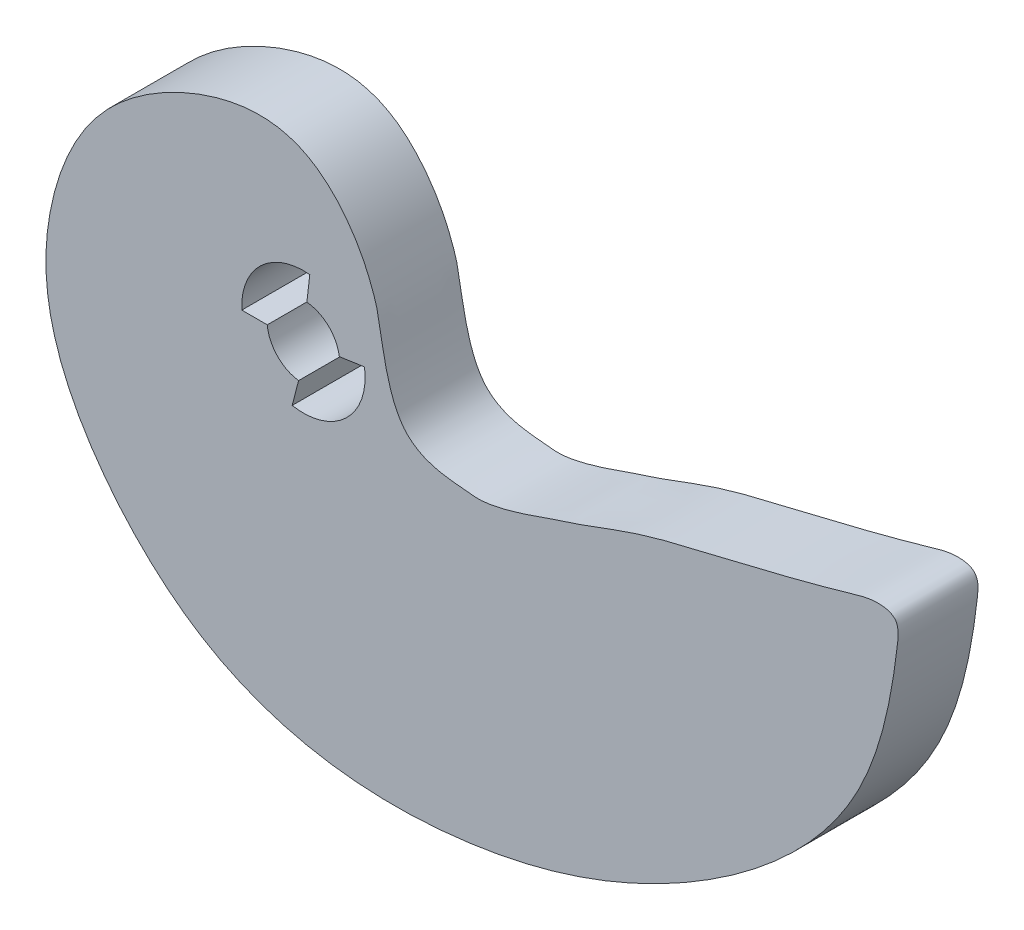
ISO-10303-21;
HEADER;
FILE_DESCRIPTION(('STEP AP214'),'2;1');
FILE_NAME('part.step','',(''),(''),'','','');
FILE_SCHEMA(('AUTOMOTIVE_DESIGN { 1 0 10303 214 1 1 1 1 }'));
ENDSEC;
DATA;
#1=APPLICATION_CONTEXT('core data for automotive mechanical design processes');
#2=APPLICATION_PROTOCOL_DEFINITION('international standard','automotive_design',2000,#1);
#3=PRODUCT_CONTEXT('',#1,'mechanical');
#4=PRODUCT('Part','Part','',(#3));
#5=PRODUCT_RELATED_PRODUCT_CATEGORY('part','',(#4));
#6=PRODUCT_DEFINITION_FORMATION('','',#4);
#7=PRODUCT_DEFINITION_CONTEXT('part definition',#1,'design');
#8=PRODUCT_DEFINITION('design','',#6,#7);
#9=PRODUCT_DEFINITION_SHAPE('','',#8);
#10=(LENGTH_UNIT() NAMED_UNIT(*) SI_UNIT(.MILLI.,.METRE.));
#11=(NAMED_UNIT(*) PLANE_ANGLE_UNIT() SI_UNIT($,.RADIAN.));
#12=(NAMED_UNIT(*) SI_UNIT($,.STERADIAN.) SOLID_ANGLE_UNIT());
#13=UNCERTAINTY_MEASURE_WITH_UNIT(LENGTH_MEASURE(1.E-05),#10,'distance_accuracy_value','');
#14=(GEOMETRIC_REPRESENTATION_CONTEXT(3) GLOBAL_UNCERTAINTY_ASSIGNED_CONTEXT((#13)) GLOBAL_UNIT_ASSIGNED_CONTEXT((#10,
#11,#12)) REPRESENTATION_CONTEXT('',''));
#15=CARTESIAN_POINT('',(0.,0.,0.));
#16=DIRECTION('',(0.,0.,1.));
#17=DIRECTION('',(1.,0.,0.));
#18=AXIS2_PLACEMENT_3D('',#15,#16,#17);
#19=CARTESIAN_POINT('',(-82.747083106505,-112.580968106267,5.5));
#20=DIRECTION('',(0.,0.,-1.));
#21=DIRECTION('',(-1.,0.,0.));
#22=AXIS2_PLACEMENT_3D('',#19,#20,#21);
#23=CYLINDRICAL_SURFACE('',#22,2.5);
#24=CARTESIAN_POINT('',(-82.747083106505,-112.580968106267,0.));
#25=DIRECTION('',(0.,0.,1.));
#26=DIRECTION('',(1.,0.,0.));
#27=AXIS2_PLACEMENT_3D('',#24,#25,#26);
#28=CIRCLE('',#27,2.5);
#29=CARTESIAN_POINT('',(-85.2365939670514,-112.809738023916,0.));
#30=VERTEX_POINT('',#29);
#31=CARTESIAN_POINT('',(-83.0804098317707,-115.058647119824,0.));
#32=VERTEX_POINT('',#31);
#33=EDGE_CURVE('E172',#30,#32,#28,.T.);
#34=ORIENTED_EDGE('',*,*,#33,.F.);
#35=DIRECTION('',(0.,0.,-1.));
#36=VECTOR('',#35,1.);
#37=CARTESIAN_POINT('',(-85.2365939670514,-112.809738023916,5.5));
#38=LINE('',#37,#36);
#39=CARTESIAN_POINT('',(-85.2365939670514,-112.809738023916,5.5));
#40=VERTEX_POINT('',#39);
#41=EDGE_CURVE('E143',#30,#40,#38,.F.);
#42=ORIENTED_EDGE('',*,*,#41,.T.);
#43=CARTESIAN_POINT('',(-82.747083106505,-112.580968106267,5.5));
#44=DIRECTION('',(0.,0.,1.));
#45=DIRECTION('',(1.,0.,0.));
#46=AXIS2_PLACEMENT_3D('',#43,#44,#45);
#47=CIRCLE('',#46,2.5);
#48=CARTESIAN_POINT('',(-83.0804098317707,-115.058647119824,5.5));
#49=VERTEX_POINT('',#48);
#50=EDGE_CURVE('E159',#40,#49,#47,.T.);
#51=ORIENTED_EDGE('',*,*,#50,.T.);
#52=DIRECTION('',(0.,0.,-1.));
#53=VECTOR('',#52,1.);
#54=CARTESIAN_POINT('',(-83.0804098317707,-115.058647119824,5.5));
#55=LINE('',#54,#53);
#56=EDGE_CURVE('E189',#32,#49,#55,.F.);
#57=ORIENTED_EDGE('',*,*,#56,.F.);
#58=EDGE_LOOP('',(#34,#42,#51,#57));
#59=FACE_BOUND('',#58,.T.);
#60=ADVANCED_FACE('F63',(#59),#23,.F.);
#61=CARTESIAN_POINT('',(-80.0538215059245,-136.913003845688,5.5));
#62=DIRECTION('',(0.,0.,1.));
#63=DIRECTION('',(1.,0.,0.));
#64=AXIS2_PLACEMENT_3D('',#61,#62,#63);
#65=PLANE('',#64);
#66=DIRECTION('',(0.114648976582669,0.993406066102149,0.));
#67=VECTOR('',#66,1.);
#68=CARTESIAN_POINT('',(-82.5091861205217,-110.092312842061,5.5));
#69=LINE('',#68,#67);
#70=CARTESIAN_POINT('',(-82.5091861205217,-110.092312842061,5.5));
#71=VERTEX_POINT('',#70);
#72=CARTESIAN_POINT('',(-82.308527743859,-108.353655816656,5.5));
#73=VERTEX_POINT('',#72);
#74=EDGE_CURVE('E134',#71,#73,#69,.T.);
#75=ORIENTED_EDGE('',*,*,#74,.F.);
#76=CARTESIAN_POINT('',(-80.2723328598114,-112.226551379108,5.5));
#77=VERTEX_POINT('',#76);
#78=EDGE_CURVE('E149',#77,#71,#47,.T.);
#79=ORIENTED_EDGE('',*,*,#78,.F.);
#80=DIRECTION('',(0.989317671002193,0.145775669584459,0.));
#81=VECTOR('',#80,1.);
#82=CARTESIAN_POINT('',(-80.2723328598114,-112.226551379108,5.5));
#83=LINE('',#82,#81);
#84=CARTESIAN_POINT('',(-78.5410185788518,-111.971442725977,5.5));
#85=VERTEX_POINT('',#84);
#86=EDGE_CURVE('E88',#77,#85,#83,.T.);
#87=ORIENTED_EDGE('',*,*,#86,.T.);
#88=CARTESIAN_POINT('',(-82.747083106505,-112.580968106267,5.5));
#89=DIRECTION('',(0.,0.,1.));
#90=DIRECTION('',(1.,0.,0.));
#91=AXIS2_PLACEMENT_3D('',#88,#89,#90);
#92=CIRCLE('',#91,4.25);
#93=CARTESIAN_POINT('',(-83.5205793740157,-116.759987551561,5.5));
#94=VERTEX_POINT('',#93);
#95=EDGE_CURVE('E220',#94,#85,#92,.T.);
#96=ORIENTED_EDGE('',*,*,#95,.F.);
#97=DIRECTION('',(-0.250472269172787,-0.968123774305453,0.));
#98=VECTOR('',#97,1.);
#99=CARTESIAN_POINT('',(-83.0804098317707,-115.058647119824,5.5));
#100=LINE('',#99,#98);
#101=EDGE_CURVE('E153',#49,#94,#100,.T.);
#102=ORIENTED_EDGE('',*,*,#101,.F.);
#103=ORIENTED_EDGE('',*,*,#50,.F.);
#104=DIRECTION('',(-1.,0.,0.));
#105=VECTOR('',#104,1.);
#106=CARTESIAN_POINT('',(-85.2365939670514,-112.809738023916,5.5));
#107=LINE('',#106,#105);
#108=CARTESIAN_POINT('',(-86.9909215017291,-112.809738023916,5.5));
#109=VERTEX_POINT('',#108);
#110=EDGE_CURVE('E80',#40,#109,#107,.T.);
#111=ORIENTED_EDGE('',*,*,#110,.T.);
#112=CARTESIAN_POINT('',(-82.747083106505,-112.580968106267,5.5));
#113=DIRECTION('',(0.,0.,1.));
#114=DIRECTION('',(1.,0.,0.));
#115=AXIS2_PLACEMENT_3D('',#112,#113,#114);
#116=CIRCLE('',#115,4.24999999999999);
#117=EDGE_CURVE('E151',#73,#109,#116,.T.);
#118=ORIENTED_EDGE('',*,*,#117,.F.);
#119=EDGE_LOOP('',(#75,#79,#87,#96,#102,#103,#111,#118));
#120=FACE_BOUND('',#119,.T.);
#121=CARTESIAN_POINT('',(-75.8241532847992,-114.266820190174,5.5));
#122=CARTESIAN_POINT('',(-77.1557221348485,-112.607928015011,5.5));
#123=CARTESIAN_POINT('',(-77.3806502648745,-108.904511464068,5.5));
#124=CARTESIAN_POINT('',(-77.8121387753091,-107.611985546066,5.5));
#125=CARTESIAN_POINT('',(-78.3917743483822,-105.871169977248,5.5));
#126=CARTESIAN_POINT('',(-80.7248505298429,-101.84142076831,5.5));
#127=CARTESIAN_POINT('',(-85.9905700927967,-99.1704683096823,5.5));
#128=CARTESIAN_POINT('',(-96.907912796097,-104.287607140387,5.5));
#129=CARTESIAN_POINT('',(-101.038879113196,-113.876150436304,5.5));
#130=CARTESIAN_POINT('',(-100.288690875967,-123.302763721377,5.5));
#131=CARTESIAN_POINT('',(-89.2694683657181,-136.537216553467,5.5));
#132=CARTESIAN_POINT('',(-73.1958659313776,-138.052646926784,5.5));
#133=CARTESIAN_POINT('',(-57.4557380507836,-133.369952636039,5.5));
#134=CARTESIAN_POINT('',(-44.6915377434276,-123.535203138772,5.5));
#135=CARTESIAN_POINT('',(-42.254163283149,-114.266033288005,5.5));
#136=CARTESIAN_POINT('',(-41.6545611837149,-108.480623839518,5.5));
#137=CARTESIAN_POINT('',(-43.4662249462023,-108.263753115962,5.5));
#138=CARTESIAN_POINT('',(-48.0536315158961,-109.641165443734,5.5));
#139=CARTESIAN_POINT('',(-52.3940668403678,-110.660212357995,5.5));
#140=CARTESIAN_POINT('',(-60.6477748421622,-112.651012095243,5.5));
#141=CARTESIAN_POINT('',(-62.5068636779673,-113.612081965851,5.5));
#142=CARTESIAN_POINT('',(-64.545834482658,-114.220651876709,5.5));
#143=CARTESIAN_POINT('',(-65.8452441277517,-114.642388057961,5.5));
#144=CARTESIAN_POINT('',(-69.596857973629,-116.123048025933,5.5));
#145=CARTESIAN_POINT('',(-72.1359343470136,-115.757636843593,5.5));
#146=CARTESIAN_POINT('',(-74.672618993993,-115.701422106837,5.5));
#147=CARTESIAN_POINT('',(-75.8241532847992,-114.266820190174,5.5));
#148=B_SPLINE_CURVE_WITH_KNOTS('',3,(#121,#122,#123,#124,#125,#126,#127,#128,#129,#130,#131,
#132,#133,#134,#135,#136,#137,#138,#139,#140,#141,#142,#143,#144,#145,#146,#147),.UNSPECIFIED.,
.T.,.F.,(4,1,1,1,1,1,1,1,1,1,1,1,1,1,1,1,1,1,1,1,1,1,1,1,4),(0.,0.0196054816471226,
0.0206373491022343,0.0221288747249968,0.0504678615574836,0.122903140937827,0.200131011844295,
0.26697729309193,0.348315634888546,0.429985039825624,0.551961090925534,0.645021424160881,
0.75099193517591,0.821689296437961,0.830772391067562,0.840595049204765,0.848258209149405,
0.899740830569315,0.910874378432394,0.950809250009911,0.953158360102707,0.954558512900311,
0.978361110459581,0.983045274449311,0.999999999999999),.UNSPECIFIED.);
#149=CARTESIAN_POINT('',(-75.8241532847992,-114.266820190174,5.5));
#150=VERTEX_POINT('',#149);
#151=EDGE_CURVE('E164',#150,#150,#148,.T.);
#152=ORIENTED_EDGE('',*,*,#151,.T.);
#153=EDGE_LOOP('',(#152));
#154=FACE_BOUND('',#153,.T.);
#155=ADVANCED_FACE('F147',(#120,#154),#65,.T.);
#156=CARTESIAN_POINT('',(-80.0538215059245,-136.913003845688,0.));
#157=DIRECTION('',(0.,0.,1.));
#158=DIRECTION('',(1.,0.,0.));
#159=AXIS2_PLACEMENT_3D('',#156,#157,#158);
#160=PLANE('',#159);
#161=CARTESIAN_POINT('',(-75.8241532847992,-114.266820190174,0.));
#162=CARTESIAN_POINT('',(-77.1557221348485,-112.607928015011,0.));
#163=CARTESIAN_POINT('',(-77.3806502648745,-108.904511464068,0.));
#164=CARTESIAN_POINT('',(-77.8121387753091,-107.611985546066,0.));
#165=CARTESIAN_POINT('',(-78.3917743483822,-105.871169977248,0.));
#166=CARTESIAN_POINT('',(-80.7248505298429,-101.84142076831,0.));
#167=CARTESIAN_POINT('',(-85.9905700927967,-99.1704683096823,0.));
#168=CARTESIAN_POINT('',(-96.907912796097,-104.287607140387,0.));
#169=CARTESIAN_POINT('',(-101.038879113196,-113.876150436304,0.));
#170=CARTESIAN_POINT('',(-100.288690875967,-123.302763721377,0.));
#171=CARTESIAN_POINT('',(-89.2694683657181,-136.537216553467,0.));
#172=CARTESIAN_POINT('',(-73.1958659313776,-138.052646926784,0.));
#173=CARTESIAN_POINT('',(-57.4557380507836,-133.369952636039,0.));
#174=CARTESIAN_POINT('',(-44.6915377434276,-123.535203138772,0.));
#175=CARTESIAN_POINT('',(-42.254163283149,-114.266033288005,0.));
#176=CARTESIAN_POINT('',(-41.6545611837149,-108.480623839518,0.));
#177=CARTESIAN_POINT('',(-43.4662249462023,-108.263753115962,0.));
#178=CARTESIAN_POINT('',(-48.0536315158961,-109.641165443734,0.));
#179=CARTESIAN_POINT('',(-52.3940668403678,-110.660212357995,0.));
#180=CARTESIAN_POINT('',(-60.6477748421622,-112.651012095243,0.));
#181=CARTESIAN_POINT('',(-62.5068636779673,-113.612081965851,0.));
#182=CARTESIAN_POINT('',(-64.545834482658,-114.220651876709,0.));
#183=CARTESIAN_POINT('',(-65.8452441277517,-114.642388057961,0.));
#184=CARTESIAN_POINT('',(-69.596857973629,-116.123048025933,0.));
#185=CARTESIAN_POINT('',(-72.1359343470136,-115.757636843593,0.));
#186=CARTESIAN_POINT('',(-74.672618993993,-115.701422106837,0.));
#187=CARTESIAN_POINT('',(-75.8241532847992,-114.266820190174,0.));
#188=B_SPLINE_CURVE_WITH_KNOTS('',3,(#161,#162,#163,#164,#165,#166,#167,#168,#169,#170,#171,
#172,#173,#174,#175,#176,#177,#178,#179,#180,#181,#182,#183,#184,#185,#186,#187),.UNSPECIFIED.,
.T.,.F.,(4,1,1,1,1,1,1,1,1,1,1,1,1,1,1,1,1,1,1,1,1,1,1,1,4),(0.,0.0196054816471226,
0.0206373491022343,0.0221288747249968,0.0504678615574836,0.122903140937827,0.200131011844295,
0.26697729309193,0.348315634888546,0.429985039825624,0.551961090925534,0.645021424160881,
0.75099193517591,0.821689296437961,0.830772391067562,0.840595049204765,0.848258209149405,
0.899740830569315,0.910874378432394,0.950809250009911,0.953158360102707,0.954558512900311,
0.978361110459581,0.983045274449311,0.999999999999999),.UNSPECIFIED.);
#189=CARTESIAN_POINT('',(-75.8241532847992,-114.266820190174,0.));
#190=VERTEX_POINT('',#189);
#191=EDGE_CURVE('E158',#190,#190,#188,.T.);
#192=ORIENTED_EDGE('',*,*,#191,.F.);
#193=EDGE_LOOP('',(#192));
#194=FACE_BOUND('',#193,.T.);
#195=CARTESIAN_POINT('',(-80.2723328598114,-112.226551379108,0.));
#196=VERTEX_POINT('',#195);
#197=CARTESIAN_POINT('',(-82.5091861205217,-110.092312842061,0.));
#198=VERTEX_POINT('',#197);
#199=EDGE_CURVE('E167',#196,#198,#28,.T.);
#200=ORIENTED_EDGE('',*,*,#199,.T.);
#201=DIRECTION('',(0.114648976582669,0.993406066102149,0.));
#202=VECTOR('',#201,1.);
#203=CARTESIAN_POINT('',(-85.5316005161024,-136.280813466655,0.));
#204=LINE('',#203,#202);
#205=CARTESIAN_POINT('',(-82.308527743859,-108.353655816656,0.));
#206=VERTEX_POINT('',#205);
#207=EDGE_CURVE('E137',#198,#206,#204,.T.);
#208=ORIENTED_EDGE('',*,*,#207,.T.);
#209=CARTESIAN_POINT('',(-82.747083106505,-112.580968106267,0.));
#210=DIRECTION('',(0.,0.,1.));
#211=DIRECTION('',(1.,0.,0.));
#212=AXIS2_PLACEMENT_3D('',#209,#210,#211);
#213=CIRCLE('',#212,4.24999999999999);
#214=CARTESIAN_POINT('',(-86.9909215017291,-112.809738023916,0.));
#215=VERTEX_POINT('',#214);
#216=EDGE_CURVE('E12',#206,#215,#213,.T.);
#217=ORIENTED_EDGE('',*,*,#216,.T.);
#218=DIRECTION('',(-1.,0.,0.));
#219=VECTOR('',#218,1.);
#220=CARTESIAN_POINT('',(-80.0538215059245,-112.809738023916,0.));
#221=LINE('',#220,#219);
#222=EDGE_CURVE('E226',#30,#215,#221,.T.);
#223=ORIENTED_EDGE('',*,*,#222,.F.);
#224=ORIENTED_EDGE('',*,*,#33,.T.);
#225=DIRECTION('',(-0.250472269172787,-0.968123774305453,0.));
#226=VECTOR('',#225,1.);
#227=CARTESIAN_POINT('',(-88.1899554238107,-134.808029276533,0.));
#228=LINE('',#227,#226);
#229=CARTESIAN_POINT('',(-83.5205793740157,-116.759987551561,0.));
#230=VERTEX_POINT('',#229);
#231=EDGE_CURVE('E201',#32,#230,#228,.T.);
#232=ORIENTED_EDGE('',*,*,#231,.T.);
#233=CARTESIAN_POINT('',(-82.747083106505,-112.580968106267,0.));
#234=DIRECTION('',(0.,0.,1.));
#235=DIRECTION('',(1.,0.,0.));
#236=AXIS2_PLACEMENT_3D('',#233,#234,#235);
#237=CIRCLE('',#236,4.25);
#238=CARTESIAN_POINT('',(-78.5410185788518,-111.971442725977,0.));
#239=VERTEX_POINT('',#238);
#240=EDGE_CURVE('E73',#230,#239,#237,.T.);
#241=ORIENTED_EDGE('',*,*,#240,.T.);
#242=DIRECTION('',(0.989317671002193,0.145775669584459,0.));
#243=VECTOR('',#242,1.);
#244=CARTESIAN_POINT('',(-83.6187068015269,-112.719638601071,0.));
#245=LINE('',#244,#243);
#246=EDGE_CURVE('E199',#196,#239,#245,.T.);
#247=ORIENTED_EDGE('',*,*,#246,.F.);
#248=EDGE_LOOP('',(#200,#208,#217,#223,#224,#232,#241,#247));
#249=FACE_BOUND('',#248,.T.);
#250=ADVANCED_FACE('F198',(#194,#249),#160,.F.);
#251=DIRECTION('',(0.,0.,-1.));
#252=VECTOR('',#251,1.);
#253=SURFACE_OF_LINEAR_EXTRUSION('',#148,#252);
#254=ORIENTED_EDGE('',*,*,#151,.F.);
#255=EDGE_LOOP('',(#254));
#256=FACE_BOUND('',#255,.T.);
#257=ORIENTED_EDGE('',*,*,#191,.T.);
#258=EDGE_LOOP('',(#257));
#259=FACE_BOUND('',#258,.T.);
#260=ADVANCED_FACE('F65',(#256,#259),#253,.F.);
#261=DIRECTION('',(0.,0.,-1.));
#262=VECTOR('',#261,1.);
#263=CARTESIAN_POINT('',(-82.5091861205217,-110.092312842061,5.5));
#264=LINE('',#263,#262);
#265=EDGE_CURVE('E130',#198,#71,#264,.F.);
#266=ORIENTED_EDGE('',*,*,#265,.F.);
#267=ORIENTED_EDGE('',*,*,#199,.F.);
#268=DIRECTION('',(0.,0.,-1.));
#269=VECTOR('',#268,1.);
#270=CARTESIAN_POINT('',(-80.2723328598114,-112.226551379108,5.5));
#271=LINE('',#270,#269);
#272=EDGE_CURVE('E156',#196,#77,#271,.F.);
#273=ORIENTED_EDGE('',*,*,#272,.T.);
#274=ORIENTED_EDGE('',*,*,#78,.T.);
#275=EDGE_LOOP('',(#266,#267,#273,#274));
#276=FACE_BOUND('',#275,.T.);
#277=ADVANCED_FACE('F155',(#276),#23,.F.);
#278=CARTESIAN_POINT('',(-82.747083106505,-112.580968106267,-4.5));
#279=DIRECTION('',(0.,0.,1.));
#280=DIRECTION('',(1.,0.,0.));
#281=AXIS2_PLACEMENT_3D('',#278,#279,#280);
#282=CYLINDRICAL_SURFACE('',#281,4.25);
#283=DIRECTION('',(0.,0.,1.));
#284=VECTOR('',#283,1.);
#285=CARTESIAN_POINT('',(-83.5205793740157,-116.759987551561,-4.5));
#286=LINE('',#285,#284);
#287=EDGE_CURVE('E207',#230,#94,#286,.T.);
#288=ORIENTED_EDGE('',*,*,#287,.T.);
#289=ORIENTED_EDGE('',*,*,#95,.T.);
#290=DIRECTION('',(0.,0.,1.));
#291=VECTOR('',#290,1.);
#292=CARTESIAN_POINT('',(-78.5410185788518,-111.971442725977,-4.5));
#293=LINE('',#292,#291);
#294=EDGE_CURVE('E209',#239,#85,#293,.T.);
#295=ORIENTED_EDGE('',*,*,#294,.F.);
#296=ORIENTED_EDGE('',*,*,#240,.F.);
#297=EDGE_LOOP('',(#288,#289,#295,#296));
#298=FACE_BOUND('',#297,.T.);
#299=ADVANCED_FACE('F205',(#298),#282,.F.);
#300=CARTESIAN_POINT('',(-83.0804098317707,-115.058647119824,-4.5));
#301=DIRECTION('',(-0.968123774305453,0.250472269172787,0.));
#302=DIRECTION('',(-0.250472269172787,-0.968123774305453,0.));
#303=AXIS2_PLACEMENT_3D('',#300,#301,#302);
#304=PLANE('',#303);
#305=ORIENTED_EDGE('',*,*,#56,.T.);
#306=ORIENTED_EDGE('',*,*,#101,.T.);
#307=ORIENTED_EDGE('',*,*,#287,.F.);
#308=ORIENTED_EDGE('',*,*,#231,.F.);
#309=EDGE_LOOP('',(#305,#306,#307,#308));
#310=FACE_BOUND('',#309,.T.);
#311=ADVANCED_FACE('F211',(#310),#304,.F.);
#312=CARTESIAN_POINT('',(-80.2723328598114,-112.226551379108,-4.5));
#313=DIRECTION('',(0.145775669584459,-0.989317671002193,0.));
#314=DIRECTION('',(0.989317671002193,0.145775669584459,0.));
#315=AXIS2_PLACEMENT_3D('',#312,#313,#314);
#316=PLANE('',#315);
#317=ORIENTED_EDGE('',*,*,#246,.T.);
#318=ORIENTED_EDGE('',*,*,#294,.T.);
#319=ORIENTED_EDGE('',*,*,#86,.F.);
#320=ORIENTED_EDGE('',*,*,#272,.F.);
#321=EDGE_LOOP('',(#317,#318,#319,#320));
#322=FACE_BOUND('',#321,.T.);
#323=ADVANCED_FACE('F316',(#322),#316,.T.);
#324=CARTESIAN_POINT('',(-82.747083106505,-112.580968106267,-4.5));
#325=DIRECTION('',(0.,0.,1.));
#326=DIRECTION('',(1.,0.,0.));
#327=AXIS2_PLACEMENT_3D('',#324,#325,#326);
#328=CYLINDRICAL_SURFACE('',#327,4.24999999999999);
#329=DIRECTION('',(0.,0.,1.));
#330=VECTOR('',#329,1.);
#331=CARTESIAN_POINT('',(-82.308527743859,-108.353655816656,-4.5));
#332=LINE('',#331,#330);
#333=EDGE_CURVE('E244',#206,#73,#332,.T.);
#334=ORIENTED_EDGE('',*,*,#333,.T.);
#335=ORIENTED_EDGE('',*,*,#117,.T.);
#336=DIRECTION('',(0.,0.,1.));
#337=VECTOR('',#336,1.);
#338=CARTESIAN_POINT('',(-86.9909215017291,-112.809738023916,-4.5));
#339=LINE('',#338,#337);
#340=EDGE_CURVE('E245',#215,#109,#339,.T.);
#341=ORIENTED_EDGE('',*,*,#340,.F.);
#342=ORIENTED_EDGE('',*,*,#216,.F.);
#343=EDGE_LOOP('',(#334,#335,#341,#342));
#344=FACE_BOUND('',#343,.T.);
#345=ADVANCED_FACE('F250',(#344),#328,.F.);
#346=CARTESIAN_POINT('',(-82.5091861205217,-110.092312842061,-4.5));
#347=DIRECTION('',(0.993406066102149,-0.114648976582669,0.));
#348=DIRECTION('',(0.114648976582669,0.993406066102149,0.));
#349=AXIS2_PLACEMENT_3D('',#346,#347,#348);
#350=PLANE('',#349);
#351=ORIENTED_EDGE('',*,*,#265,.T.);
#352=ORIENTED_EDGE('',*,*,#74,.T.);
#353=ORIENTED_EDGE('',*,*,#333,.F.);
#354=ORIENTED_EDGE('',*,*,#207,.F.);
#355=EDGE_LOOP('',(#351,#352,#353,#354));
#356=FACE_BOUND('',#355,.T.);
#357=ADVANCED_FACE('F132',(#356),#350,.F.);
#358=CARTESIAN_POINT('',(-85.2365939670514,-112.809738023916,-4.5));
#359=DIRECTION('',(0.,1.,0.));
#360=DIRECTION('',(0.,0.,1.));
#361=AXIS2_PLACEMENT_3D('',#358,#359,#360);
#362=PLANE('',#361);
#363=ORIENTED_EDGE('',*,*,#222,.T.);
#364=ORIENTED_EDGE('',*,*,#340,.T.);
#365=ORIENTED_EDGE('',*,*,#110,.F.);
#366=ORIENTED_EDGE('',*,*,#41,.F.);
#367=EDGE_LOOP('',(#363,#364,#365,#366));
#368=FACE_BOUND('',#367,.T.);
#369=ADVANCED_FACE('F251',(#368),#362,.T.);
#370=CLOSED_SHELL('',(#60,#155,#250,#260,#277,#299,#311,#323,#345,#357,#369));
#371=MANIFOLD_SOLID_BREP('B2',#370);
#372=ADVANCED_BREP_SHAPE_REPRESENTATION('',(#18,#371),#14);
#373=SHAPE_DEFINITION_REPRESENTATION(#9,#372);
ENDSEC;
END-ISO-10303-21;
